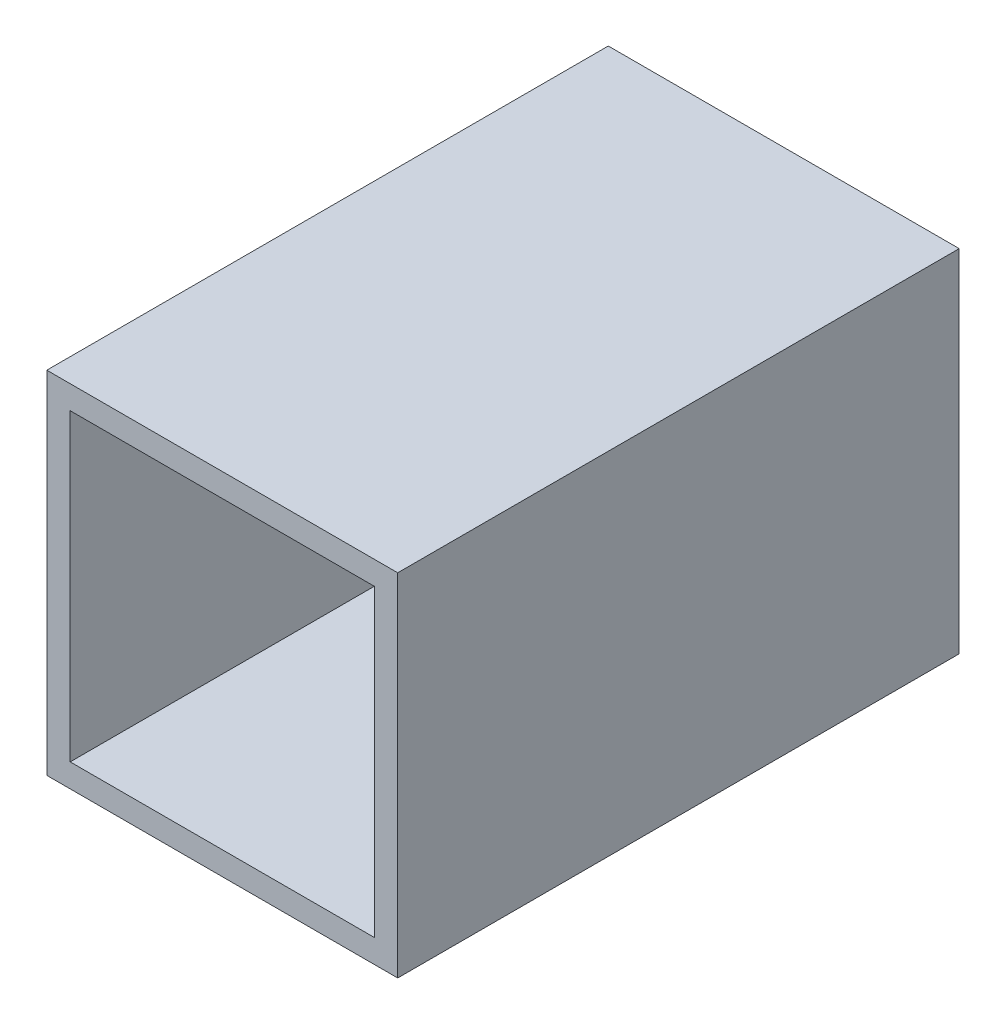
ISO-10303-21;
HEADER;
FILE_DESCRIPTION(('STEP AP214'),'2;1');
FILE_NAME('part.step','',(''),(''),'','','');
FILE_SCHEMA(('AUTOMOTIVE_DESIGN { 1 0 10303 214 1 1 1 1 }'));
ENDSEC;
DATA;
#1=APPLICATION_CONTEXT('core data for automotive mechanical design processes');
#2=APPLICATION_PROTOCOL_DEFINITION('international standard','automotive_design',2000,#1);
#3=PRODUCT_CONTEXT('',#1,'mechanical');
#4=PRODUCT('Part','Part','',(#3));
#5=PRODUCT_RELATED_PRODUCT_CATEGORY('part','',(#4));
#6=PRODUCT_DEFINITION_FORMATION('','',#4);
#7=PRODUCT_DEFINITION_CONTEXT('part definition',#1,'design');
#8=PRODUCT_DEFINITION('design','',#6,#7);
#9=PRODUCT_DEFINITION_SHAPE('','',#8);
#10=(LENGTH_UNIT() NAMED_UNIT(*) SI_UNIT(.MILLI.,.METRE.));
#11=(NAMED_UNIT(*) PLANE_ANGLE_UNIT() SI_UNIT($,.RADIAN.));
#12=(NAMED_UNIT(*) SI_UNIT($,.STERADIAN.) SOLID_ANGLE_UNIT());
#13=UNCERTAINTY_MEASURE_WITH_UNIT(LENGTH_MEASURE(1.E-05),#10,'distance_accuracy_value','');
#14=(GEOMETRIC_REPRESENTATION_CONTEXT(3) GLOBAL_UNCERTAINTY_ASSIGNED_CONTEXT((#13)) GLOBAL_UNIT_ASSIGNED_CONTEXT((#10,
#11,#12)) REPRESENTATION_CONTEXT('',''));
#15=CARTESIAN_POINT('',(0.,0.,0.));
#16=DIRECTION('',(0.,0.,1.));
#17=DIRECTION('',(1.,0.,0.));
#18=AXIS2_PLACEMENT_3D('',#15,#16,#17);
#19=CARTESIAN_POINT('',(0.,0.,60.96));
#20=DIRECTION('',(0.,0.,1.));
#21=DIRECTION('',(1.,0.,0.));
#22=AXIS2_PLACEMENT_3D('',#19,#20,#21);
#23=PLANE('',#22);
#24=DIRECTION('',(0.,-1.,0.));
#25=VECTOR('',#24,1.);
#26=CARTESIAN_POINT('',(-36.7999984749819,15.1309638399672,60.96));
#27=LINE('',#26,#25);
#28=CARTESIAN_POINT('',(-36.7999984749819,15.1309638399672,60.96));
#29=VERTEX_POINT('',#28);
#30=CARTESIAN_POINT('',(-36.7999984749818,-22.9690361600328,60.96));
#31=VERTEX_POINT('',#30);
#32=EDGE_CURVE('E134',#29,#31,#27,.T.);
#33=ORIENTED_EDGE('',*,*,#32,.T.);
#34=DIRECTION('',(1.,0.,0.));
#35=VECTOR('',#34,1.);
#36=CARTESIAN_POINT('',(-36.7999984749818,-22.9690361600328,60.96));
#37=LINE('',#36,#35);
#38=CARTESIAN_POINT('',(1.30000152501816,-22.9690361600328,60.96));
#39=VERTEX_POINT('',#38);
#40=EDGE_CURVE('E137',#31,#39,#37,.T.);
#41=ORIENTED_EDGE('',*,*,#40,.T.);
#42=DIRECTION('',(0.,1.,0.));
#43=VECTOR('',#42,1.);
#44=CARTESIAN_POINT('',(1.30000152501814,15.1309638399672,60.96));
#45=LINE('',#44,#43);
#46=CARTESIAN_POINT('',(1.30000152501814,15.1309638399672,60.96));
#47=VERTEX_POINT('',#46);
#48=EDGE_CURVE('E140',#39,#47,#45,.T.);
#49=ORIENTED_EDGE('',*,*,#48,.T.);
#50=DIRECTION('',(-1.,0.,0.));
#51=VECTOR('',#50,1.);
#52=CARTESIAN_POINT('',(-36.7999984749819,15.1309638399672,60.96));
#53=LINE('',#52,#51);
#54=EDGE_CURVE('E142',#47,#29,#53,.T.);
#55=ORIENTED_EDGE('',*,*,#54,.T.);
#56=EDGE_LOOP('',(#33,#41,#49,#55));
#57=FACE_BOUND('',#56,.T.);
#58=DIRECTION('',(1.,0.,0.));
#59=VECTOR('',#58,1.);
#60=CARTESIAN_POINT('',(-34.2599984749819,-20.4290361600328,60.96));
#61=LINE('',#60,#59);
#62=CARTESIAN_POINT('',(-34.2599984749819,-20.4290361600328,60.96));
#63=VERTEX_POINT('',#62);
#64=CARTESIAN_POINT('',(-1.23999847498186,-20.4290361600328,60.96));
#65=VERTEX_POINT('',#64);
#66=EDGE_CURVE('E106',#63,#65,#61,.T.);
#67=ORIENTED_EDGE('',*,*,#66,.F.);
#68=DIRECTION('',(0.,-1.,0.));
#69=VECTOR('',#68,1.);
#70=CARTESIAN_POINT('',(-34.2599984749819,12.5909638399672,60.96));
#71=LINE('',#70,#69);
#72=CARTESIAN_POINT('',(-34.2599984749819,12.5909638399672,60.96));
#73=VERTEX_POINT('',#72);
#74=EDGE_CURVE('E98',#73,#63,#71,.T.);
#75=ORIENTED_EDGE('',*,*,#74,.F.);
#76=DIRECTION('',(-1.,0.,0.));
#77=VECTOR('',#76,1.);
#78=CARTESIAN_POINT('',(-34.2599984749819,12.5909638399672,60.96));
#79=LINE('',#78,#77);
#80=CARTESIAN_POINT('',(-1.23999847498186,12.5909638399672,60.96));
#81=VERTEX_POINT('',#80);
#82=EDGE_CURVE('E120',#81,#73,#79,.T.);
#83=ORIENTED_EDGE('',*,*,#82,.F.);
#84=DIRECTION('',(0.,1.,0.));
#85=VECTOR('',#84,1.);
#86=CARTESIAN_POINT('',(-1.23999847498186,12.5909638399672,60.96));
#87=LINE('',#86,#85);
#88=EDGE_CURVE('E118',#65,#81,#87,.T.);
#89=ORIENTED_EDGE('',*,*,#88,.F.);
#90=EDGE_LOOP('',(#67,#75,#83,#89));
#91=FACE_BOUND('',#90,.T.);
#92=ADVANCED_FACE('F33',(#57,#91),#23,.T.);
#93=CARTESIAN_POINT('',(0.,0.,0.));
#94=DIRECTION('',(0.,0.,1.));
#95=DIRECTION('',(1.,0.,0.));
#96=AXIS2_PLACEMENT_3D('',#93,#94,#95);
#97=PLANE('',#96);
#98=DIRECTION('',(0.,-1.,0.));
#99=VECTOR('',#98,1.);
#100=CARTESIAN_POINT('',(-36.7999984749819,15.1309638399672,0.));
#101=LINE('',#100,#99);
#102=CARTESIAN_POINT('',(-36.7999984749819,15.1309638399672,0.));
#103=VERTEX_POINT('',#102);
#104=CARTESIAN_POINT('',(-36.7999984749818,-22.9690361600328,0.));
#105=VERTEX_POINT('',#104);
#106=EDGE_CURVE('E114',#103,#105,#101,.T.);
#107=ORIENTED_EDGE('',*,*,#106,.F.);
#108=DIRECTION('',(-1.,0.,0.));
#109=VECTOR('',#108,1.);
#110=CARTESIAN_POINT('',(-36.7999984749819,15.1309638399672,0.));
#111=LINE('',#110,#109);
#112=CARTESIAN_POINT('',(1.30000152501814,15.1309638399672,0.));
#113=VERTEX_POINT('',#112);
#114=EDGE_CURVE('E138',#113,#103,#111,.T.);
#115=ORIENTED_EDGE('',*,*,#114,.F.);
#116=DIRECTION('',(0.,1.,0.));
#117=VECTOR('',#116,1.);
#118=CARTESIAN_POINT('',(1.30000152501814,15.1309638399672,0.));
#119=LINE('',#118,#117);
#120=CARTESIAN_POINT('',(1.30000152501816,-22.9690361600328,0.));
#121=VERTEX_POINT('',#120);
#122=EDGE_CURVE('E149',#121,#113,#119,.T.);
#123=ORIENTED_EDGE('',*,*,#122,.F.);
#124=DIRECTION('',(1.,0.,0.));
#125=VECTOR('',#124,1.);
#126=CARTESIAN_POINT('',(-36.7999984749818,-22.9690361600328,0.));
#127=LINE('',#126,#125);
#128=EDGE_CURVE('E147',#105,#121,#127,.T.);
#129=ORIENTED_EDGE('',*,*,#128,.F.);
#130=EDGE_LOOP('',(#107,#115,#123,#129));
#131=FACE_BOUND('',#130,.T.);
#132=DIRECTION('',(0.,-1.,0.));
#133=VECTOR('',#132,1.);
#134=CARTESIAN_POINT('',(-34.2599984749819,12.5909638399672,0.));
#135=LINE('',#134,#133);
#136=CARTESIAN_POINT('',(-34.2599984749819,12.5909638399672,0.));
#137=VERTEX_POINT('',#136);
#138=CARTESIAN_POINT('',(-34.2599984749819,-20.4290361600328,0.));
#139=VERTEX_POINT('',#138);
#140=EDGE_CURVE('E56',#137,#139,#135,.T.);
#141=ORIENTED_EDGE('',*,*,#140,.T.);
#142=DIRECTION('',(1.,0.,0.));
#143=VECTOR('',#142,1.);
#144=CARTESIAN_POINT('',(-34.2599984749819,-20.4290361600328,0.));
#145=LINE('',#144,#143);
#146=CARTESIAN_POINT('',(-1.23999847498186,-20.4290361600328,0.));
#147=VERTEX_POINT('',#146);
#148=EDGE_CURVE('E113',#139,#147,#145,.T.);
#149=ORIENTED_EDGE('',*,*,#148,.T.);
#150=DIRECTION('',(0.,1.,0.));
#151=VECTOR('',#150,1.);
#152=CARTESIAN_POINT('',(-1.23999847498186,12.5909638399672,0.));
#153=LINE('',#152,#151);
#154=CARTESIAN_POINT('',(-1.23999847498186,12.5909638399672,0.));
#155=VERTEX_POINT('',#154);
#156=EDGE_CURVE('E126',#147,#155,#153,.T.);
#157=ORIENTED_EDGE('',*,*,#156,.T.);
#158=DIRECTION('',(-1.,0.,0.));
#159=VECTOR('',#158,1.);
#160=CARTESIAN_POINT('',(-34.2599984749819,12.5909638399672,0.));
#161=LINE('',#160,#159);
#162=EDGE_CURVE('E107',#155,#137,#161,.T.);
#163=ORIENTED_EDGE('',*,*,#162,.T.);
#164=EDGE_LOOP('',(#141,#149,#157,#163));
#165=FACE_BOUND('',#164,.T.);
#166=ADVANCED_FACE('F167',(#131,#165),#97,.F.);
#167=CARTESIAN_POINT('',(-36.7999984749819,15.1309638399672,60.96));
#168=DIRECTION('',(1.,0.,0.));
#169=DIRECTION('',(0.,1.,0.));
#170=AXIS2_PLACEMENT_3D('',#167,#168,#169);
#171=PLANE('',#170);
#172=ORIENTED_EDGE('',*,*,#106,.T.);
#173=DIRECTION('',(0.,0.,-1.));
#174=VECTOR('',#173,1.);
#175=CARTESIAN_POINT('',(-36.7999984749818,-22.9690361600328,60.96));
#176=LINE('',#175,#174);
#177=EDGE_CURVE('E11',#31,#105,#176,.T.);
#178=ORIENTED_EDGE('',*,*,#177,.F.);
#179=ORIENTED_EDGE('',*,*,#32,.F.);
#180=DIRECTION('',(0.,0.,-1.));
#181=VECTOR('',#180,1.);
#182=CARTESIAN_POINT('',(-36.7999984749819,15.1309638399672,60.96));
#183=LINE('',#182,#181);
#184=EDGE_CURVE('E144',#29,#103,#183,.T.);
#185=ORIENTED_EDGE('',*,*,#184,.T.);
#186=EDGE_LOOP('',(#172,#178,#179,#185));
#187=FACE_BOUND('',#186,.T.);
#188=ADVANCED_FACE('F35',(#187),#171,.F.);
#189=CARTESIAN_POINT('',(-36.7999984749818,-22.9690361600328,60.96));
#190=DIRECTION('',(0.,1.,0.));
#191=DIRECTION('',(0.,0.,1.));
#192=AXIS2_PLACEMENT_3D('',#189,#190,#191);
#193=PLANE('',#192);
#194=ORIENTED_EDGE('',*,*,#128,.T.);
#195=DIRECTION('',(0.,0.,-1.));
#196=VECTOR('',#195,1.);
#197=CARTESIAN_POINT('',(1.30000152501816,-22.9690361600328,60.96));
#198=LINE('',#197,#196);
#199=EDGE_CURVE('E41',#39,#121,#198,.T.);
#200=ORIENTED_EDGE('',*,*,#199,.F.);
#201=ORIENTED_EDGE('',*,*,#40,.F.);
#202=ORIENTED_EDGE('',*,*,#177,.T.);
#203=EDGE_LOOP('',(#194,#200,#201,#202));
#204=FACE_BOUND('',#203,.T.);
#205=ADVANCED_FACE('F177',(#204),#193,.F.);
#206=CARTESIAN_POINT('',(1.30000152501814,15.1309638399672,60.96));
#207=DIRECTION('',(-1.,0.,0.));
#208=DIRECTION('',(0.,-1.,0.));
#209=AXIS2_PLACEMENT_3D('',#206,#207,#208);
#210=PLANE('',#209);
#211=ORIENTED_EDGE('',*,*,#122,.T.);
#212=DIRECTION('',(0.,0.,-1.));
#213=VECTOR('',#212,1.);
#214=CARTESIAN_POINT('',(1.30000152501814,15.1309638399672,60.96));
#215=LINE('',#214,#213);
#216=EDGE_CURVE('E154',#47,#113,#215,.T.);
#217=ORIENTED_EDGE('',*,*,#216,.F.);
#218=ORIENTED_EDGE('',*,*,#48,.F.);
#219=ORIENTED_EDGE('',*,*,#199,.T.);
#220=EDGE_LOOP('',(#211,#217,#218,#219));
#221=FACE_BOUND('',#220,.T.);
#222=ADVANCED_FACE('F161',(#221),#210,.F.);
#223=CARTESIAN_POINT('',(-36.7999984749819,15.1309638399672,60.96));
#224=DIRECTION('',(0.,-1.,0.));
#225=DIRECTION('',(0.,0.,-1.));
#226=AXIS2_PLACEMENT_3D('',#223,#224,#225);
#227=PLANE('',#226);
#228=ORIENTED_EDGE('',*,*,#114,.T.);
#229=ORIENTED_EDGE('',*,*,#184,.F.);
#230=ORIENTED_EDGE('',*,*,#54,.F.);
#231=ORIENTED_EDGE('',*,*,#216,.T.);
#232=EDGE_LOOP('',(#228,#229,#230,#231));
#233=FACE_BOUND('',#232,.T.);
#234=ADVANCED_FACE('F171',(#233),#227,.F.);
#235=CARTESIAN_POINT('',(-34.2599984749819,12.5909638399672,60.96));
#236=DIRECTION('',(1.,0.,0.));
#237=DIRECTION('',(0.,0.,-1.));
#238=AXIS2_PLACEMENT_3D('',#235,#236,#237);
#239=PLANE('',#238);
#240=ORIENTED_EDGE('',*,*,#140,.F.);
#241=DIRECTION('',(0.,0.,-1.));
#242=VECTOR('',#241,1.);
#243=CARTESIAN_POINT('',(-34.2599984749819,12.5909638399672,60.96));
#244=LINE('',#243,#242);
#245=EDGE_CURVE('E102',#73,#137,#244,.T.);
#246=ORIENTED_EDGE('',*,*,#245,.F.);
#247=ORIENTED_EDGE('',*,*,#74,.T.);
#248=DIRECTION('',(0.,0.,-1.));
#249=VECTOR('',#248,1.);
#250=CARTESIAN_POINT('',(-34.2599984749819,-20.4290361600328,60.96));
#251=LINE('',#250,#249);
#252=EDGE_CURVE('E101',#63,#139,#251,.T.);
#253=ORIENTED_EDGE('',*,*,#252,.T.);
#254=EDGE_LOOP('',(#240,#246,#247,#253));
#255=FACE_BOUND('',#254,.T.);
#256=ADVANCED_FACE('F100',(#255),#239,.T.);
#257=CARTESIAN_POINT('',(-34.2599984749819,-20.4290361600328,60.96));
#258=DIRECTION('',(0.,1.,0.));
#259=DIRECTION('',(0.,0.,1.));
#260=AXIS2_PLACEMENT_3D('',#257,#258,#259);
#261=PLANE('',#260);
#262=ORIENTED_EDGE('',*,*,#148,.F.);
#263=ORIENTED_EDGE('',*,*,#252,.F.);
#264=ORIENTED_EDGE('',*,*,#66,.T.);
#265=DIRECTION('',(0.,0.,-1.));
#266=VECTOR('',#265,1.);
#267=CARTESIAN_POINT('',(-1.23999847498186,-20.4290361600328,60.96));
#268=LINE('',#267,#266);
#269=EDGE_CURVE('E115',#65,#147,#268,.T.);
#270=ORIENTED_EDGE('',*,*,#269,.T.);
#271=EDGE_LOOP('',(#262,#263,#264,#270));
#272=FACE_BOUND('',#271,.T.);
#273=ADVANCED_FACE('F110',(#272),#261,.T.);
#274=CARTESIAN_POINT('',(-1.23999847498186,12.5909638399672,60.96));
#275=DIRECTION('',(-1.,0.,0.));
#276=DIRECTION('',(0.,-1.,0.));
#277=AXIS2_PLACEMENT_3D('',#274,#275,#276);
#278=PLANE('',#277);
#279=ORIENTED_EDGE('',*,*,#156,.F.);
#280=ORIENTED_EDGE('',*,*,#269,.F.);
#281=ORIENTED_EDGE('',*,*,#88,.T.);
#282=DIRECTION('',(0.,0.,-1.));
#283=VECTOR('',#282,1.);
#284=CARTESIAN_POINT('',(-1.23999847498186,12.5909638399672,60.96));
#285=LINE('',#284,#283);
#286=EDGE_CURVE('E48',#81,#155,#285,.T.);
#287=ORIENTED_EDGE('',*,*,#286,.T.);
#288=EDGE_LOOP('',(#279,#280,#281,#287));
#289=FACE_BOUND('',#288,.T.);
#290=ADVANCED_FACE('F200',(#289),#278,.T.);
#291=CARTESIAN_POINT('',(-34.2599984749819,12.5909638399672,60.96));
#292=DIRECTION('',(0.,-1.,0.));
#293=DIRECTION('',(0.,0.,-1.));
#294=AXIS2_PLACEMENT_3D('',#291,#292,#293);
#295=PLANE('',#294);
#296=ORIENTED_EDGE('',*,*,#162,.F.);
#297=ORIENTED_EDGE('',*,*,#286,.F.);
#298=ORIENTED_EDGE('',*,*,#82,.T.);
#299=ORIENTED_EDGE('',*,*,#245,.T.);
#300=EDGE_LOOP('',(#296,#297,#298,#299));
#301=FACE_BOUND('',#300,.T.);
#302=ADVANCED_FACE('F204',(#301),#295,.T.);
#303=CLOSED_SHELL('',(#92,#166,#188,#205,#222,#234,#256,#273,#290,#302));
#304=MANIFOLD_SOLID_BREP('B2',#303);
#305=ADVANCED_BREP_SHAPE_REPRESENTATION('',(#18,#304),#14);
#306=SHAPE_DEFINITION_REPRESENTATION(#9,#305);
ENDSEC;
END-ISO-10303-21;
